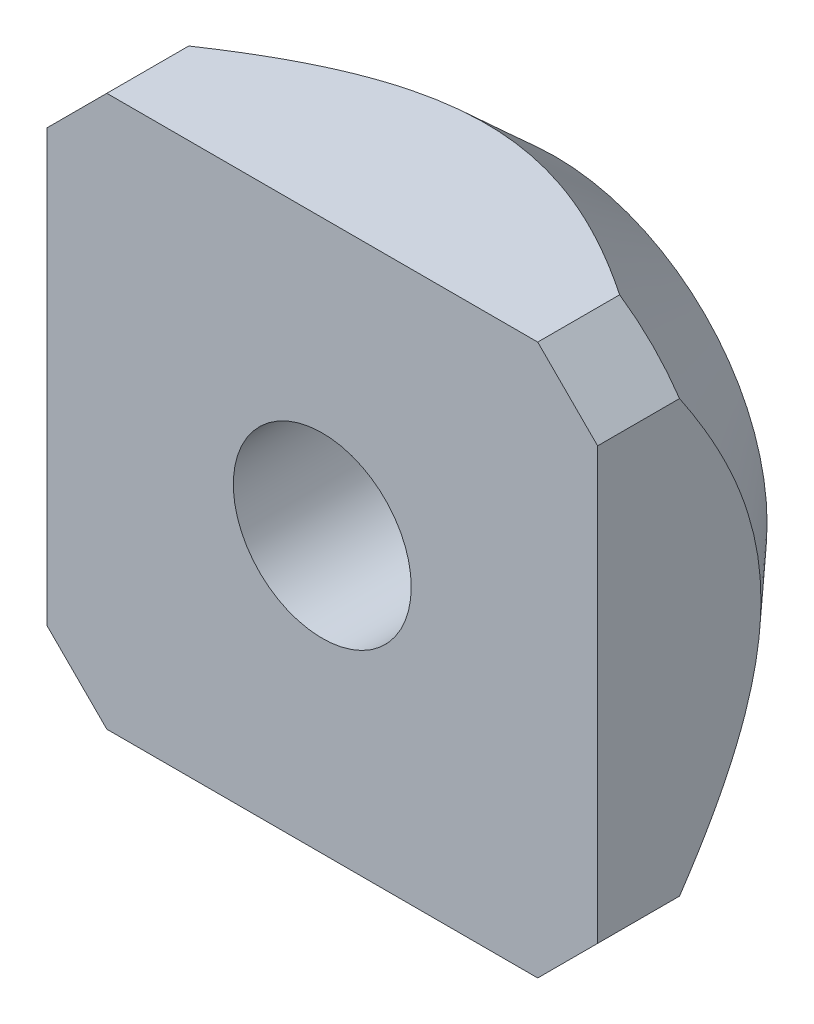
ISO-10303-21;
HEADER;
FILE_DESCRIPTION(('STEP AP214'),'2;1');
FILE_NAME('part.step','',(''),(''),'','','');
FILE_SCHEMA(('AUTOMOTIVE_DESIGN { 1 0 10303 214 1 1 1 1 }'));
ENDSEC;
DATA;
#1=APPLICATION_CONTEXT('core data for automotive mechanical design processes');
#2=APPLICATION_PROTOCOL_DEFINITION('international standard','automotive_design',2000,#1);
#3=PRODUCT_CONTEXT('',#1,'mechanical');
#4=PRODUCT('Part','Part','',(#3));
#5=PRODUCT_RELATED_PRODUCT_CATEGORY('part','',(#4));
#6=PRODUCT_DEFINITION_FORMATION('','',#4);
#7=PRODUCT_DEFINITION_CONTEXT('part definition',#1,'design');
#8=PRODUCT_DEFINITION('design','',#6,#7);
#9=PRODUCT_DEFINITION_SHAPE('','',#8);
#10=(LENGTH_UNIT() NAMED_UNIT(*) SI_UNIT(.MILLI.,.METRE.));
#11=(NAMED_UNIT(*) PLANE_ANGLE_UNIT() SI_UNIT($,.RADIAN.));
#12=(NAMED_UNIT(*) SI_UNIT($,.STERADIAN.) SOLID_ANGLE_UNIT());
#13=UNCERTAINTY_MEASURE_WITH_UNIT(LENGTH_MEASURE(1.E-05),#10,'distance_accuracy_value','');
#14=(GEOMETRIC_REPRESENTATION_CONTEXT(3) GLOBAL_UNCERTAINTY_ASSIGNED_CONTEXT((#13)) GLOBAL_UNIT_ASSIGNED_CONTEXT((#10,
#11,#12)) REPRESENTATION_CONTEXT('',''));
#15=CARTESIAN_POINT('',(0.,0.,0.));
#16=DIRECTION('',(0.,0.,1.));
#17=DIRECTION('',(1.,0.,0.));
#18=AXIS2_PLACEMENT_3D('',#15,#16,#17);
#19=CARTESIAN_POINT('',(0.,0.,-5.5));
#20=DIRECTION('',(0.,0.,1.));
#21=DIRECTION('',(1.,0.,0.));
#22=AXIS2_PLACEMENT_3D('',#19,#20,#21);
#23=PLANE('',#22);
#24=CARTESIAN_POINT('',(0.,0.,-5.5));
#25=DIRECTION('',(0.,0.,1.));
#26=DIRECTION('',(1.,0.,0.));
#27=AXIS2_PLACEMENT_3D('',#24,#25,#26);
#28=CIRCLE('',#27,2.1);
#29=CARTESIAN_POINT('',(2.1,0.,-5.5));
#30=VERTEX_POINT('',#29);
#31=EDGE_CURVE('E246',#30,#30,#28,.T.);
#32=ORIENTED_EDGE('',*,*,#31,.T.);
#33=EDGE_LOOP('',(#32));
#34=FACE_BOUND('',#33,.T.);
#35=CARTESIAN_POINT('',(0.,0.,-5.50000000287154));
#36=DIRECTION('',(0.,0.,1.));
#37=DIRECTION('',(1.,0.,0.));
#38=AXIS2_PLACEMENT_3D('',#35,#36,#37);
#39=CIRCLE('',#38,5.00000000314824);
#40=CARTESIAN_POINT('',(5.00000000314824,0.,-5.50000000287154));
#41=VERTEX_POINT('',#40);
#42=EDGE_CURVE('E33',#41,#41,#39,.T.);
#43=ORIENTED_EDGE('',*,*,#42,.F.);
#44=EDGE_LOOP('',(#43));
#45=FACE_BOUND('',#44,.T.);
#46=ADVANCED_FACE('F30',(#34,#45),#23,.F.);
#47=CARTESIAN_POINT('',(0.,0.,-1.91193420733516));
#48=DIRECTION('',(0.,0.,1.));
#49=DIRECTION('',(1.,0.,0.));
#50=AXIS2_PLACEMENT_3D('',#47,#48,#49);
#51=CONICAL_SURFACE('',#50,8.27271392518171,0.739466056088912);
#52=ORIENTED_EDGE('',*,*,#42,.T.);
#53=EDGE_LOOP('',(#52));
#54=FACE_BOUND('',#53,.T.);
#55=CARTESIAN_POINT('',(-6.49999999996656,5.08578643774263,-1.93333420218814));
#56=CARTESIAN_POINT('',(-6.49999999998799,4.97217656549041,-2.01007902749409));
#57=CARTESIAN_POINT('',(-6.49999999999678,4.85782950972393,-2.08574579284289));
#58=CARTESIAN_POINT('',(-6.50000000000322,4.62749756275461,-2.23459577320099));
#59=CARTESIAN_POINT('',(-6.50000000000086,4.51151233122406,-2.30777846107305));
#60=CARTESIAN_POINT('',(-6.49999999999913,4.27735001893202,-2.45156937006614));
#61=CARTESIAN_POINT('',(-6.49999999999976,4.15916634847437,-2.52216690472437));
#62=CARTESIAN_POINT('',(-6.50000000000024,3.92090179825337,-2.66006146574261));
#63=CARTESIAN_POINT('',(-6.50000000000008,3.80082102170299,-2.72735867084667));
#64=CARTESIAN_POINT('',(-6.49999999999983,3.43117049901182,-2.927024197621));
#65=CARTESIAN_POINT('',(-6.49999999999995,3.17828163281151,-3.05336340735418));
#66=CARTESIAN_POINT('',(-6.50000000000004,2.66320472724055,-3.2847897494762));
#67=CARTESIAN_POINT('',(-6.50000000000001,2.40103115726329,-3.38990837532806));
#68=CARTESIAN_POINT('',(-6.49999999999999,1.96194937878003,-3.54007016332442));
#69=CARTESIAN_POINT('',(-6.5,1.78780916432668,-3.5931930058844));
#70=CARTESIAN_POINT('',(-6.5,1.43593803357401,-3.68604206605222));
#71=CARTESIAN_POINT('',(-6.5,1.25820705951024,-3.72576806796325));
#72=CARTESIAN_POINT('',(-6.5,0.901971243864608,-3.78972854936986));
#73=CARTESIAN_POINT('',(-6.5,0.723496609813822,-3.81412921930872));
#74=CARTESIAN_POINT('',(-6.5,0.365074863040264,-3.84691624104865));
#75=CARTESIAN_POINT('',(-6.5,0.185127876429945,-3.85530395029257));
#76=CARTESIAN_POINT('',(-6.5,-0.175331996863656,-3.85561829853934));
#77=CARTESIAN_POINT('',(-6.5,-0.355844930170432,-3.84749448568778));
#78=CARTESIAN_POINT('',(-6.5,-0.715412000901114,-3.81512247996494));
#79=CARTESIAN_POINT('',(-6.5,-0.894466007670494,-3.79087285866508));
#80=CARTESIAN_POINT('',(-6.5,-1.25186987190293,-3.72710369302864));
#81=CARTESIAN_POINT('',(-6.5,-1.43018938883302,-3.6874161876482));
#82=CARTESIAN_POINT('',(-6.5,-1.7832209983363,-3.59454247061222));
#83=CARTESIAN_POINT('',(-6.5,-1.95793314761956,-3.54135647133646));
#84=CARTESIAN_POINT('',(-6.5,-2.39791270686289,-3.39110767153733));
#85=CARTESIAN_POINT('',(-6.5,-2.66041462883235,-3.2859613732665));
#86=CARTESIAN_POINT('',(-6.5,-3.17612601907367,-3.05441341529704));
#87=CARTESIAN_POINT('',(-6.5,-3.4293209389517,-2.92798006949308));
#88=CARTESIAN_POINT('',(-6.5,-3.79940591229883,-2.72814379751195));
#89=CARTESIAN_POINT('',(-6.5,-3.91962359960432,-2.66078705978884));
#90=CARTESIAN_POINT('',(-6.5,-4.15815744619399,-2.52276484072712));
#91=CARTESIAN_POINT('',(-6.5,-4.27647350172637,-2.45209917967338));
#92=CARTESIAN_POINT('',(-6.5,-4.510894297226,-2.30816632365151));
#93=CARTESIAN_POINT('',(-6.5,-4.62700566745187,-2.23490988206234));
#94=CARTESIAN_POINT('',(-6.5,-4.85758619181249,-2.08590677964123));
#95=CARTESIAN_POINT('',(-6.5,-4.97205568825616,-2.01016064904319));
#96=CARTESIAN_POINT('',(-6.5,-5.08578643774838,-1.93333420220499));
#97=B_SPLINE_CURVE_WITH_KNOTS('',3,(#55,#56,#57,#58,#59,#60,#61,#62,#63,#64,#65,#66,#67,#68,#69,
#70,#71,#72,#73,#74,#75,#76,#77,#78,#79,#80,#81,#82,#83,#84,#85,#86,#87,#88,#89,#90,#91,#92,#93,
#94,#95,#96),.UNSPECIFIED.,.F.,.F.,(4,2,2,2,2,2,2,2,2,2,2,2,2,2,2,2,2,2,2,2,4),(0.,
0.41131042679013,0.822707597462602,1.23564791332838,1.64856583981778,2.49590493844257,
3.34197710361053,3.88772071571207,4.43347311417834,4.97320018567055,5.51288150165221,
6.05421432221896,6.59559510058552,7.1430386002873,7.69047348727104,8.53748456918338,
9.38576777125056,9.79913116863559,10.2125170428237,10.6243522063669,11.0361002217524),.UNSPECIFIED.);
#98=CARTESIAN_POINT('',(-6.50000000001247,5.08578643767711,-1.93333420224238));
#99=VERTEX_POINT('',#98);
#100=CARTESIAN_POINT('',(-6.50000000001247,-5.08578643767711,-1.93333420224238));
#101=VERTEX_POINT('',#100);
#102=EDGE_CURVE('E159',#99,#101,#97,.T.);
#103=ORIENTED_EDGE('',*,*,#102,.F.);
#104=CARTESIAN_POINT('',(-5.08578643758324,6.50000000000418,-1.93333420227152));
#105=CARTESIAN_POINT('',(-5.20320338743552,6.38258305017716,-1.95544496406807));
#106=CARTESIAN_POINT('',(-5.32114245529566,6.26464398232743,-1.97213629505099));
#107=CARTESIAN_POINT('',(-5.55702028333326,6.02876615429746,-1.99438943436884));
#108=CARTESIAN_POINT('',(-5.6749567510727,5.9108296865553,-2.00000000038364));
#109=CARTESIAN_POINT('',(-5.91082968655301,5.67495675107281,-2.00000000038308));
#110=CARTESIAN_POINT('',(-6.02876615429389,5.55702028333248,-1.99438943436772));
#111=CARTESIAN_POINT('',(-6.2646439823281,5.32114245529936,-1.97213629505239));
#112=CARTESIAN_POINT('',(-6.38258305018337,5.20320338744464,-1.95544496407257));
#113=CARTESIAN_POINT('',(-6.50000000002287,5.08578643760404,-1.93333420228277));
#114=B_SPLINE_CURVE_WITH_KNOTS('',3,(#104,#105,#106,#107,#108,#109,#110,#111,#112,#113),
.UNSPECIFIED.,.F.,.F.,(4,2,2,2,4),(0.,0.502492195093159,1.00276834929097,1.50304450348823,
2.00553669858084),.UNSPECIFIED.);
#115=CARTESIAN_POINT('',(-5.08578643767711,6.50000000001248,-1.93333420224238));
#116=VERTEX_POINT('',#115);
#117=EDGE_CURVE('E165',#116,#99,#114,.T.);
#118=ORIENTED_EDGE('',*,*,#117,.F.);
#119=CARTESIAN_POINT('',(5.08578643774263,6.49999999996657,-1.93333420218813));
#120=CARTESIAN_POINT('',(4.9721765654904,6.49999999998799,-2.01007902749409));
#121=CARTESIAN_POINT('',(4.85782950972392,6.49999999999678,-2.08574579284289));
#122=CARTESIAN_POINT('',(4.62749756275461,6.50000000000322,-2.23459577320099));
#123=CARTESIAN_POINT('',(4.51151233122406,6.50000000000087,-2.30777846107305));
#124=CARTESIAN_POINT('',(4.27735001893202,6.49999999999913,-2.45156937006614));
#125=CARTESIAN_POINT('',(4.15916634847437,6.49999999999976,-2.52216690472436));
#126=CARTESIAN_POINT('',(3.92090179825336,6.50000000000024,-2.66006146574261));
#127=CARTESIAN_POINT('',(3.80082102170299,6.50000000000009,-2.72735867084667));
#128=CARTESIAN_POINT('',(3.43117049901181,6.49999999999983,-2.927024197621));
#129=CARTESIAN_POINT('',(3.17828163281151,6.49999999999996,-3.05336340735418));
#130=CARTESIAN_POINT('',(2.66320472724054,6.50000000000005,-3.2847897494762));
#131=CARTESIAN_POINT('',(2.40103115726328,6.50000000000001,-3.38990837532806));
#132=CARTESIAN_POINT('',(1.96194937878002,6.5,-3.54007016332442));
#133=CARTESIAN_POINT('',(1.78780916432667,6.5,-3.5931930058844));
#134=CARTESIAN_POINT('',(1.435938033574,6.50000000000001,-3.68604206605221));
#135=CARTESIAN_POINT('',(1.25820705951023,6.5,-3.72576806796325));
#136=CARTESIAN_POINT('',(0.901971243864601,6.5,-3.78972854936986));
#137=CARTESIAN_POINT('',(0.723496609813815,6.5,-3.81412921930872));
#138=CARTESIAN_POINT('',(0.365074863040257,6.5,-3.84691624104865));
#139=CARTESIAN_POINT('',(0.185127876429939,6.5,-3.85530395029256));
#140=CARTESIAN_POINT('',(-0.175331996863662,6.5,-3.85561829853934));
#141=CARTESIAN_POINT('',(-0.355844930170438,6.5,-3.84749448568778));
#142=CARTESIAN_POINT('',(-0.715412000901119,6.5,-3.81512247996494));
#143=CARTESIAN_POINT('',(-0.8944660076705,6.5,-3.79087285866508));
#144=CARTESIAN_POINT('',(-1.25186987190293,6.5,-3.72710369302863));
#145=CARTESIAN_POINT('',(-1.43018938883303,6.5,-3.68741618764819));
#146=CARTESIAN_POINT('',(-1.7832209983363,6.5,-3.59454247061221));
#147=CARTESIAN_POINT('',(-1.95793314761956,6.5,-3.54135647133646));
#148=CARTESIAN_POINT('',(-2.3979127068629,6.5,-3.39110767153733));
#149=CARTESIAN_POINT('',(-2.66041462883235,6.5,-3.2859613732665));
#150=CARTESIAN_POINT('',(-3.17612601907368,6.5,-3.05441341529704));
#151=CARTESIAN_POINT('',(-3.4293209389517,6.5,-2.92798006949307));
#152=CARTESIAN_POINT('',(-3.79940591229883,6.5,-2.72814379751195));
#153=CARTESIAN_POINT('',(-3.91962359960432,6.5,-2.66078705978884));
#154=CARTESIAN_POINT('',(-4.15815744619399,6.5,-2.52276484072712));
#155=CARTESIAN_POINT('',(-4.27647350172636,6.5,-2.45209917967338));
#156=CARTESIAN_POINT('',(-4.510894297226,6.5,-2.30816632365151));
#157=CARTESIAN_POINT('',(-4.62700566745187,6.5,-2.23490988206234));
#158=CARTESIAN_POINT('',(-4.85758619181248,6.5,-2.08590677964123));
#159=CARTESIAN_POINT('',(-4.97205568825616,6.5,-2.01016064904319));
#160=CARTESIAN_POINT('',(-5.08578643774838,6.5,-1.93333420220499));
#161=B_SPLINE_CURVE_WITH_KNOTS('',3,(#119,#120,#121,#122,#123,#124,#125,#126,#127,#128,#129,
#130,#131,#132,#133,#134,#135,#136,#137,#138,#139,#140,#141,#142,#143,#144,#145,#146,#147,#148,
#149,#150,#151,#152,#153,#154,#155,#156,#157,#158,#159,#160),.UNSPECIFIED.,.F.,.F.,(4,2,2,2,2,2,
2,2,2,2,2,2,2,2,2,2,2,2,2,2,4),(0.,0.411310426790131,0.822707597462601,1.23564791332838,
1.64856583981778,2.49590493844257,3.34197710361053,3.88772071571208,4.43347311417834,
4.97320018567055,5.51288150165221,6.05421432221896,6.59559510058552,7.1430386002873,
7.69047348727104,8.53748456918337,9.38576777125056,9.79913116863558,10.2125170428237,
10.6243522063669,11.0361002217524),.UNSPECIFIED.);
#162=CARTESIAN_POINT('',(5.08578643767711,6.50000000001247,-1.93333420224238));
#163=VERTEX_POINT('',#162);
#164=EDGE_CURVE('E99',#163,#116,#161,.T.);
#165=ORIENTED_EDGE('',*,*,#164,.F.);
#166=CARTESIAN_POINT('',(6.50000000000418,5.08578643758324,-1.93333420227152));
#167=CARTESIAN_POINT('',(6.38258305017715,5.20320338743553,-1.95544496406807));
#168=CARTESIAN_POINT('',(6.26464398232743,5.32114245529566,-1.97213629505098));
#169=CARTESIAN_POINT('',(6.02876615429745,5.55702028333326,-1.99438943436883));
#170=CARTESIAN_POINT('',(5.9108296865553,5.6749567510727,-2.00000000038364));
#171=CARTESIAN_POINT('',(5.67495675107281,5.91082968655302,-2.00000000038307));
#172=CARTESIAN_POINT('',(5.55702028333247,6.02876615429389,-1.99438943436771));
#173=CARTESIAN_POINT('',(5.32114245529936,6.2646439823281,-1.97213629505239));
#174=CARTESIAN_POINT('',(5.20320338744464,6.38258305018337,-1.95544496407257));
#175=CARTESIAN_POINT('',(5.08578643760404,6.50000000002287,-1.93333420228276));
#176=B_SPLINE_CURVE_WITH_KNOTS('',3,(#166,#167,#168,#169,#170,#171,#172,#173,#174,#175),
.UNSPECIFIED.,.F.,.F.,(4,2,2,2,4),(0.,0.502492195093158,1.00276834929097,1.50304450348823,
2.00553669858084),.UNSPECIFIED.);
#177=CARTESIAN_POINT('',(6.50000000001247,5.08578643761444,-1.93333420228472));
#178=VERTEX_POINT('',#177);
#179=EDGE_CURVE('E93',#178,#163,#176,.T.);
#180=ORIENTED_EDGE('',*,*,#179,.F.);
#181=CARTESIAN_POINT('',(6.49999999996656,-5.08578643774263,-1.93333420218813));
#182=CARTESIAN_POINT('',(6.49999999998799,-4.97217656549041,-2.01007902749409));
#183=CARTESIAN_POINT('',(6.49999999999678,-4.85782950972392,-2.08574579284288));
#184=CARTESIAN_POINT('',(6.50000000000322,-4.62749756275461,-2.23459577320098));
#185=CARTESIAN_POINT('',(6.50000000000087,-4.51151233122406,-2.30777846107305));
#186=CARTESIAN_POINT('',(6.49999999999913,-4.27735001893202,-2.45156937006614));
#187=CARTESIAN_POINT('',(6.49999999999976,-4.15916634847437,-2.52216690472436));
#188=CARTESIAN_POINT('',(6.50000000000024,-3.92090179825336,-2.6600614657426));
#189=CARTESIAN_POINT('',(6.50000000000008,-3.80082102170299,-2.72735867084666));
#190=CARTESIAN_POINT('',(6.49999999999983,-3.43117049901182,-2.927024197621));
#191=CARTESIAN_POINT('',(6.49999999999996,-3.17828163281151,-3.05336340735417));
#192=CARTESIAN_POINT('',(6.50000000000005,-2.66320472724054,-3.2847897494762));
#193=CARTESIAN_POINT('',(6.50000000000001,-2.40103115726328,-3.38990837532806));
#194=CARTESIAN_POINT('',(6.49999999999999,-1.96194937878003,-3.54007016332441));
#195=CARTESIAN_POINT('',(6.5,-1.78780916432667,-3.5931930058844));
#196=CARTESIAN_POINT('',(6.5,-1.435938033574,-3.68604206605221));
#197=CARTESIAN_POINT('',(6.5,-1.25820705951023,-3.72576806796324));
#198=CARTESIAN_POINT('',(6.5,-0.901971243864601,-3.78972854936985));
#199=CARTESIAN_POINT('',(6.5,-0.723496609813815,-3.81412921930872));
#200=CARTESIAN_POINT('',(6.5,-0.365074863040257,-3.84691624104865));
#201=CARTESIAN_POINT('',(6.5,-0.185127876429938,-3.85530395029256));
#202=CARTESIAN_POINT('',(6.5,0.175331996863663,-3.85561829853934));
#203=CARTESIAN_POINT('',(6.5,0.355844930170439,-3.84749448568778));
#204=CARTESIAN_POINT('',(6.5,0.715412000901121,-3.81512247996494));
#205=CARTESIAN_POINT('',(6.5,0.894466007670502,-3.79087285866508));
#206=CARTESIAN_POINT('',(6.5,1.25186987190294,-3.72710369302863));
#207=CARTESIAN_POINT('',(6.5,1.43018938883303,-3.68741618764819));
#208=CARTESIAN_POINT('',(6.5,1.7832209983363,-3.59454247061221));
#209=CARTESIAN_POINT('',(6.5,1.95793314761957,-3.54135647133646));
#210=CARTESIAN_POINT('',(6.5,2.3979127068629,-3.39110767153733));
#211=CARTESIAN_POINT('',(6.5,2.66041462883236,-3.2859613732665));
#212=CARTESIAN_POINT('',(6.5,3.17612601907368,-3.05441341529703));
#213=CARTESIAN_POINT('',(6.5,3.42932093895171,-2.92798006949307));
#214=CARTESIAN_POINT('',(6.5,3.79940591229883,-2.72814379751194));
#215=CARTESIAN_POINT('',(6.5,3.91962359960432,-2.66078705978883));
#216=CARTESIAN_POINT('',(6.5,4.15815744619399,-2.52276484072711));
#217=CARTESIAN_POINT('',(6.5,4.27647350172637,-2.45209917967337));
#218=CARTESIAN_POINT('',(6.5,4.51089429722601,-2.30816632365151));
#219=CARTESIAN_POINT('',(6.5,4.62700566745188,-2.23490988206234));
#220=CARTESIAN_POINT('',(6.5,4.85758619181249,-2.08590677964122));
#221=CARTESIAN_POINT('',(6.5,4.97205568825616,-2.01016064904319));
#222=CARTESIAN_POINT('',(6.5,5.08578643774839,-1.93333420220499));
#223=B_SPLINE_CURVE_WITH_KNOTS('',3,(#181,#182,#183,#184,#185,#186,#187,#188,#189,#190,#191,
#192,#193,#194,#195,#196,#197,#198,#199,#200,#201,#202,#203,#204,#205,#206,#207,#208,#209,#210,
#211,#212,#213,#214,#215,#216,#217,#218,#219,#220,#221,#222),.UNSPECIFIED.,.F.,.F.,(4,2,2,2,2,2,
2,2,2,2,2,2,2,2,2,2,2,2,2,2,4),(0.,0.411310426790131,0.822707597462602,1.23564791332838,
1.64856583981778,2.49590493844257,3.34197710361053,3.88772071571208,4.43347311417835,
4.97320018567056,5.51288150165222,6.05421432221896,6.59559510058553,7.14303860028731,
7.69047348727105,8.53748456918338,9.38576777125057,9.79913116863559,10.2125170428237,
10.6243522063669,11.0361002217524),.UNSPECIFIED.);
#224=CARTESIAN_POINT('',(6.50000000001247,-5.08578643767711,-1.93333420224237));
#225=VERTEX_POINT('',#224);
#226=EDGE_CURVE('E97',#225,#178,#223,.T.);
#227=ORIENTED_EDGE('',*,*,#226,.F.);
#228=CARTESIAN_POINT('',(5.08578643758324,-6.50000000000418,-1.93333420227152));
#229=CARTESIAN_POINT('',(5.20320338743552,-6.38258305017716,-1.95544496406807));
#230=CARTESIAN_POINT('',(5.32114245529566,-6.26464398232743,-1.97213629505098));
#231=CARTESIAN_POINT('',(5.55702028333326,-6.02876615429746,-1.99438943436883));
#232=CARTESIAN_POINT('',(5.6749567510727,-5.9108296865553,-2.00000000038364));
#233=CARTESIAN_POINT('',(5.91082968655301,-5.67495675107281,-2.00000000038307));
#234=CARTESIAN_POINT('',(6.02876615429389,-5.55702028333248,-1.99438943436771));
#235=CARTESIAN_POINT('',(6.2646439823281,-5.32114245529936,-1.97213629505238));
#236=CARTESIAN_POINT('',(6.38258305018337,-5.20320338744464,-1.95544496407256));
#237=CARTESIAN_POINT('',(6.50000000002286,-5.08578643760405,-1.93333420228276));
#238=B_SPLINE_CURVE_WITH_KNOTS('',3,(#228,#229,#230,#231,#232,#233,#234,#235,#236,#237),
.UNSPECIFIED.,.F.,.F.,(4,2,2,2,4),(0.,0.502492195093158,1.00276834929097,1.50304450348823,
2.00553669858084),.UNSPECIFIED.);
#239=CARTESIAN_POINT('',(5.08578643767711,-6.50000000001247,-1.93333420224237));
#240=VERTEX_POINT('',#239);
#241=EDGE_CURVE('E113',#240,#225,#238,.T.);
#242=ORIENTED_EDGE('',*,*,#241,.F.);
#243=CARTESIAN_POINT('',(-5.08578643774262,-6.49999999996657,-1.93333420218813));
#244=CARTESIAN_POINT('',(-4.9721765654904,-6.49999999998799,-2.01007902749409));
#245=CARTESIAN_POINT('',(-4.85782950972392,-6.49999999999678,-2.08574579284288));
#246=CARTESIAN_POINT('',(-4.62749756275461,-6.50000000000322,-2.23459577320099));
#247=CARTESIAN_POINT('',(-4.51151233122405,-6.50000000000087,-2.30777846107305));
#248=CARTESIAN_POINT('',(-4.27735001893202,-6.49999999999913,-2.45156937006614));
#249=CARTESIAN_POINT('',(-4.15916634847437,-6.49999999999976,-2.52216690472436));
#250=CARTESIAN_POINT('',(-3.92090179825336,-6.50000000000024,-2.6600614657426));
#251=CARTESIAN_POINT('',(-3.80082102170298,-6.50000000000009,-2.72735867084667));
#252=CARTESIAN_POINT('',(-3.43117049901181,-6.49999999999983,-2.927024197621));
#253=CARTESIAN_POINT('',(-3.1782816328115,-6.49999999999996,-3.05336340735418));
#254=CARTESIAN_POINT('',(-2.66320472724054,-6.50000000000005,-3.2847897494762));
#255=CARTESIAN_POINT('',(-2.40103115726328,-6.50000000000001,-3.38990837532806));
#256=CARTESIAN_POINT('',(-1.96194937878002,-6.5,-3.54007016332441));
#257=CARTESIAN_POINT('',(-1.78780916432667,-6.5,-3.5931930058844));
#258=CARTESIAN_POINT('',(-1.435938033574,-6.5,-3.68604206605221));
#259=CARTESIAN_POINT('',(-1.25820705951023,-6.5,-3.72576806796324));
#260=CARTESIAN_POINT('',(-0.9019712438646,-6.5,-3.78972854936985));
#261=CARTESIAN_POINT('',(-0.723496609813814,-6.5,-3.81412921930872));
#262=CARTESIAN_POINT('',(-0.365074863040256,-6.5,-3.84691624104865));
#263=CARTESIAN_POINT('',(-0.185127876429937,-6.5,-3.85530395029256));
#264=CARTESIAN_POINT('',(0.175331996863664,-6.5,-3.85561829853933));
#265=CARTESIAN_POINT('',(0.35584493017044,-6.5,-3.84749448568777));
#266=CARTESIAN_POINT('',(0.715412000901122,-6.5,-3.81512247996493));
#267=CARTESIAN_POINT('',(0.894466007670503,-6.5,-3.79087285866508));
#268=CARTESIAN_POINT('',(1.25186987190294,-6.5,-3.72710369302863));
#269=CARTESIAN_POINT('',(1.43018938883303,-6.5,-3.68741618764819));
#270=CARTESIAN_POINT('',(1.7832209983363,-6.5,-3.59454247061221));
#271=CARTESIAN_POINT('',(1.95793314761957,-6.5,-3.54135647133645));
#272=CARTESIAN_POINT('',(2.3979127068629,-6.5,-3.39110767153732));
#273=CARTESIAN_POINT('',(2.66041462883236,-6.5,-3.28596137326649));
#274=CARTESIAN_POINT('',(3.17612601907368,-6.5,-3.05441341529703));
#275=CARTESIAN_POINT('',(3.42932093895171,-6.5,-2.92798006949307));
#276=CARTESIAN_POINT('',(3.79940591229883,-6.5,-2.72814379751194));
#277=CARTESIAN_POINT('',(3.91962359960432,-6.5,-2.66078705978883));
#278=CARTESIAN_POINT('',(4.15815744619399,-6.5,-2.52276484072711));
#279=CARTESIAN_POINT('',(4.27647350172637,-6.5,-2.45209917967337));
#280=CARTESIAN_POINT('',(4.510894297226,-6.5,-2.30816632365151));
#281=CARTESIAN_POINT('',(4.62700566745187,-6.5,-2.23490988206233));
#282=CARTESIAN_POINT('',(4.85758619181248,-6.5,-2.08590677964122));
#283=CARTESIAN_POINT('',(4.97205568825616,-6.5,-2.01016064904318));
#284=CARTESIAN_POINT('',(5.08578643774838,-6.5,-1.93333420220499));
#285=B_SPLINE_CURVE_WITH_KNOTS('',3,(#243,#244,#245,#246,#247,#248,#249,#250,#251,#252,#253,
#254,#255,#256,#257,#258,#259,#260,#261,#262,#263,#264,#265,#266,#267,#268,#269,#270,#271,#272,
#273,#274,#275,#276,#277,#278,#279,#280,#281,#282,#283,#284),.UNSPECIFIED.,.F.,.F.,(4,2,2,2,2,2,
2,2,2,2,2,2,2,2,2,2,2,2,2,2,4),(0.,0.411310426790131,0.822707597462601,1.23564791332838,
1.64856583981778,2.49590493844257,3.34197710361053,3.88772071571207,4.43347311417834,
4.97320018567055,5.51288150165221,6.05421432221896,6.59559510058552,7.1430386002873,
7.69047348727104,8.53748456918338,9.38576777125056,9.79913116863558,10.2125170428237,
10.6243522063669,11.0361002217524),.UNSPECIFIED.);
#286=CARTESIAN_POINT('',(-5.08578643767711,-6.50000000001247,-1.93333420224237));
#287=VERTEX_POINT('',#286);
#288=EDGE_CURVE('E146',#287,#240,#285,.T.);
#289=ORIENTED_EDGE('',*,*,#288,.F.);
#290=CARTESIAN_POINT('',(-6.50000000000418,-5.08578643758324,-1.93333420227152));
#291=CARTESIAN_POINT('',(-6.38258305017715,-5.20320338743553,-1.95544496406807));
#292=CARTESIAN_POINT('',(-6.26464398232743,-5.32114245529566,-1.97213629505099));
#293=CARTESIAN_POINT('',(-6.02876615429745,-5.55702028333326,-1.99438943436883));
#294=CARTESIAN_POINT('',(-5.9108296865553,-5.6749567510727,-2.00000000038364));
#295=CARTESIAN_POINT('',(-5.6749567510728,-5.91082968655301,-2.00000000038307));
#296=CARTESIAN_POINT('',(-5.55702028333247,-6.02876615429389,-1.99438943436771));
#297=CARTESIAN_POINT('',(-5.32114245529935,-6.2646439823281,-1.97213629505239));
#298=CARTESIAN_POINT('',(-5.20320338744463,-6.38258305018337,-1.95544496407257));
#299=CARTESIAN_POINT('',(-5.08578643760404,-6.50000000002287,-1.93333420228276));
#300=B_SPLINE_CURVE_WITH_KNOTS('',3,(#290,#291,#292,#293,#294,#295,#296,#297,#298,#299),
.UNSPECIFIED.,.F.,.F.,(4,2,2,2,4),(0.,0.50249219509316,1.00276834929097,1.50304450348824,
2.00553669858085),.UNSPECIFIED.);
#301=EDGE_CURVE('E153',#101,#287,#300,.T.);
#302=ORIENTED_EDGE('',*,*,#301,.F.);
#303=EDGE_LOOP('',(#103,#118,#165,#180,#227,#242,#289,#302));
#304=FACE_BOUND('',#303,.T.);
#305=ADVANCED_FACE('F95',(#54,#304),#51,.T.);
#306=CARTESIAN_POINT('',(6.5,5.08578643762691,0.));
#307=DIRECTION('',(0.707106781186548,0.707106781186548,0.));
#308=DIRECTION('',(-0.707106781186548,0.707106781186548,0.));
#309=AXIS2_PLACEMENT_3D('',#306,#307,#308);
#310=PLANE('',#309);
#311=DIRECTION('',(-0.707106781186547,0.707106781186547,0.));
#312=VECTOR('',#311,1.);
#313=CARTESIAN_POINT('',(6.5,5.08578643762691,0.));
#314=LINE('',#313,#312);
#315=CARTESIAN_POINT('',(6.5,5.08578643762691,0.));
#316=VERTEX_POINT('',#315);
#317=CARTESIAN_POINT('',(5.08578643762691,6.5,0.));
#318=VERTEX_POINT('',#317);
#319=EDGE_CURVE('E106',#316,#318,#314,.T.);
#320=ORIENTED_EDGE('',*,*,#319,.F.);
#321=DIRECTION('',(0.,0.,-1.));
#322=VECTOR('',#321,1.);
#323=CARTESIAN_POINT('',(6.5,5.08578643762691,0.));
#324=LINE('',#323,#322);
#325=EDGE_CURVE('E103',#178,#316,#324,.F.);
#326=ORIENTED_EDGE('',*,*,#325,.F.);
#327=ORIENTED_EDGE('',*,*,#179,.T.);
#328=DIRECTION('',(0.,0.,1.));
#329=VECTOR('',#328,1.);
#330=CARTESIAN_POINT('',(5.08578643762691,6.5,0.));
#331=LINE('',#330,#329);
#332=EDGE_CURVE('E172',#318,#163,#331,.F.);
#333=ORIENTED_EDGE('',*,*,#332,.F.);
#334=EDGE_LOOP('',(#320,#326,#327,#333));
#335=FACE_BOUND('',#334,.T.);
#336=ADVANCED_FACE('F104',(#335),#310,.T.);
#337=CARTESIAN_POINT('',(5.08578643762691,6.5,0.));
#338=DIRECTION('',(0.,1.,0.));
#339=DIRECTION('',(0.,0.,1.));
#340=AXIS2_PLACEMENT_3D('',#337,#338,#339);
#341=PLANE('',#340);
#342=DIRECTION('',(1.,0.,0.));
#343=VECTOR('',#342,1.);
#344=CARTESIAN_POINT('',(0.,6.5,0.));
#345=LINE('',#344,#343);
#346=CARTESIAN_POINT('',(-5.0857864376269,6.50000000000001,0.));
#347=VERTEX_POINT('',#346);
#348=EDGE_CURVE('E121',#318,#347,#345,.F.);
#349=ORIENTED_EDGE('',*,*,#348,.F.);
#350=ORIENTED_EDGE('',*,*,#332,.T.);
#351=ORIENTED_EDGE('',*,*,#164,.T.);
#352=DIRECTION('',(0.,0.,1.));
#353=VECTOR('',#352,1.);
#354=CARTESIAN_POINT('',(-5.0857864376269,6.50000000000001,0.));
#355=LINE('',#354,#353);
#356=EDGE_CURVE('E171',#347,#116,#355,.F.);
#357=ORIENTED_EDGE('',*,*,#356,.F.);
#358=EDGE_LOOP('',(#349,#350,#351,#357));
#359=FACE_BOUND('',#358,.T.);
#360=ADVANCED_FACE('F180',(#359),#341,.T.);
#361=CARTESIAN_POINT('',(-5.0857864376269,6.50000000000001,0.));
#362=DIRECTION('',(-0.707106781186548,0.707106781186548,0.));
#363=DIRECTION('',(-0.707106781186548,-0.707106781186548,0.));
#364=AXIS2_PLACEMENT_3D('',#361,#362,#363);
#365=PLANE('',#364);
#366=DIRECTION('',(-0.707106781186547,-0.707106781186547,0.));
#367=VECTOR('',#366,1.);
#368=CARTESIAN_POINT('',(-5.0857864376269,6.50000000000001,0.));
#369=LINE('',#368,#367);
#370=CARTESIAN_POINT('',(-6.5,5.08578643762691,0.));
#371=VERTEX_POINT('',#370);
#372=EDGE_CURVE('E219',#347,#371,#369,.T.);
#373=ORIENTED_EDGE('',*,*,#372,.F.);
#374=ORIENTED_EDGE('',*,*,#356,.T.);
#375=ORIENTED_EDGE('',*,*,#117,.T.);
#376=DIRECTION('',(0.,0.,1.));
#377=VECTOR('',#376,1.);
#378=CARTESIAN_POINT('',(-6.5,5.08578643762691,0.));
#379=LINE('',#378,#377);
#380=EDGE_CURVE('E226',#371,#99,#379,.F.);
#381=ORIENTED_EDGE('',*,*,#380,.F.);
#382=EDGE_LOOP('',(#373,#374,#375,#381));
#383=FACE_BOUND('',#382,.T.);
#384=ADVANCED_FACE('F176',(#383),#365,.T.);
#385=CARTESIAN_POINT('',(-6.5,5.08578643762691,0.));
#386=DIRECTION('',(-1.,0.,0.));
#387=DIRECTION('',(0.,0.,1.));
#388=AXIS2_PLACEMENT_3D('',#385,#386,#387);
#389=PLANE('',#388);
#390=DIRECTION('',(0.,1.,0.));
#391=VECTOR('',#390,1.);
#392=CARTESIAN_POINT('',(-6.5,0.,0.));
#393=LINE('',#392,#391);
#394=CARTESIAN_POINT('',(-6.5,-5.08578643762691,0.));
#395=VERTEX_POINT('',#394);
#396=EDGE_CURVE('E217',#371,#395,#393,.F.);
#397=ORIENTED_EDGE('',*,*,#396,.F.);
#398=ORIENTED_EDGE('',*,*,#380,.T.);
#399=ORIENTED_EDGE('',*,*,#102,.T.);
#400=DIRECTION('',(0.,0.,1.));
#401=VECTOR('',#400,1.);
#402=CARTESIAN_POINT('',(-6.5,-5.08578643762691,0.));
#403=LINE('',#402,#401);
#404=EDGE_CURVE('E232',#395,#101,#403,.F.);
#405=ORIENTED_EDGE('',*,*,#404,.F.);
#406=EDGE_LOOP('',(#397,#398,#399,#405));
#407=FACE_BOUND('',#406,.T.);
#408=ADVANCED_FACE('F179',(#407),#389,.T.);
#409=CARTESIAN_POINT('',(-6.5,-5.08578643762691,0.));
#410=DIRECTION('',(-0.707106781186548,-0.707106781186548,0.));
#411=DIRECTION('',(0.707106781186548,-0.707106781186548,0.));
#412=AXIS2_PLACEMENT_3D('',#409,#410,#411);
#413=PLANE('',#412);
#414=DIRECTION('',(0.707106781186547,-0.707106781186548,0.));
#415=VECTOR('',#414,1.);
#416=CARTESIAN_POINT('',(-6.5,-5.08578643762691,0.));
#417=LINE('',#416,#415);
#418=CARTESIAN_POINT('',(-5.08578643762691,-6.5,0.));
#419=VERTEX_POINT('',#418);
#420=EDGE_CURVE('E211',#395,#419,#417,.T.);
#421=ORIENTED_EDGE('',*,*,#420,.F.);
#422=ORIENTED_EDGE('',*,*,#404,.T.);
#423=ORIENTED_EDGE('',*,*,#301,.T.);
#424=DIRECTION('',(0.,0.,-1.));
#425=VECTOR('',#424,1.);
#426=CARTESIAN_POINT('',(-5.08578643762691,-6.5,0.));
#427=LINE('',#426,#425);
#428=EDGE_CURVE('E238',#419,#287,#427,.T.);
#429=ORIENTED_EDGE('',*,*,#428,.F.);
#430=EDGE_LOOP('',(#421,#422,#423,#429));
#431=FACE_BOUND('',#430,.T.);
#432=ADVANCED_FACE('F235',(#431),#413,.T.);
#433=CARTESIAN_POINT('',(-5.08578643762691,-6.5,0.));
#434=DIRECTION('',(0.,-1.,0.));
#435=DIRECTION('',(0.,0.,-1.));
#436=AXIS2_PLACEMENT_3D('',#433,#434,#435);
#437=PLANE('',#436);
#438=DIRECTION('',(1.,0.,0.));
#439=VECTOR('',#438,1.);
#440=CARTESIAN_POINT('',(0.,-6.5,0.));
#441=LINE('',#440,#439);
#442=CARTESIAN_POINT('',(5.08578643762691,-6.5,0.));
#443=VERTEX_POINT('',#442);
#444=EDGE_CURVE('E209',#419,#443,#441,.T.);
#445=ORIENTED_EDGE('',*,*,#444,.F.);
#446=ORIENTED_EDGE('',*,*,#428,.T.);
#447=ORIENTED_EDGE('',*,*,#288,.T.);
#448=DIRECTION('',(0.,0.,1.));
#449=VECTOR('',#448,1.);
#450=CARTESIAN_POINT('',(5.08578643762691,-6.5,0.));
#451=LINE('',#450,#449);
#452=EDGE_CURVE('E110',#443,#240,#451,.F.);
#453=ORIENTED_EDGE('',*,*,#452,.F.);
#454=EDGE_LOOP('',(#445,#446,#447,#453));
#455=FACE_BOUND('',#454,.T.);
#456=ADVANCED_FACE('F242',(#455),#437,.T.);
#457=CARTESIAN_POINT('',(5.08578643762691,-6.5,0.));
#458=DIRECTION('',(0.707106781186548,-0.707106781186548,0.));
#459=DIRECTION('',(0.707106781186548,0.707106781186548,0.));
#460=AXIS2_PLACEMENT_3D('',#457,#458,#459);
#461=PLANE('',#460);
#462=DIRECTION('',(0.707106781186547,0.707106781186548,0.));
#463=VECTOR('',#462,1.);
#464=CARTESIAN_POINT('',(5.08578643762691,-6.5,0.));
#465=LINE('',#464,#463);
#466=CARTESIAN_POINT('',(6.5,-5.08578643762691,0.));
#467=VERTEX_POINT('',#466);
#468=EDGE_CURVE('E39',#443,#467,#465,.T.);
#469=ORIENTED_EDGE('',*,*,#468,.F.);
#470=ORIENTED_EDGE('',*,*,#452,.T.);
#471=ORIENTED_EDGE('',*,*,#241,.T.);
#472=DIRECTION('',(0.,0.,-1.));
#473=VECTOR('',#472,1.);
#474=CARTESIAN_POINT('',(6.5,-5.08578643762691,0.));
#475=LINE('',#474,#473);
#476=EDGE_CURVE('E48',#467,#225,#475,.T.);
#477=ORIENTED_EDGE('',*,*,#476,.F.);
#478=EDGE_LOOP('',(#469,#470,#471,#477));
#479=FACE_BOUND('',#478,.T.);
#480=ADVANCED_FACE('F200',(#479),#461,.T.);
#481=CARTESIAN_POINT('',(6.5,-5.08578643762691,0.));
#482=DIRECTION('',(1.,0.,0.));
#483=DIRECTION('',(0.,0.,-1.));
#484=AXIS2_PLACEMENT_3D('',#481,#482,#483);
#485=PLANE('',#484);
#486=DIRECTION('',(0.,1.,0.));
#487=VECTOR('',#486,1.);
#488=CARTESIAN_POINT('',(6.5,0.,0.));
#489=LINE('',#488,#487);
#490=EDGE_CURVE('E11',#467,#316,#489,.T.);
#491=ORIENTED_EDGE('',*,*,#490,.F.);
#492=ORIENTED_EDGE('',*,*,#476,.T.);
#493=ORIENTED_EDGE('',*,*,#226,.T.);
#494=ORIENTED_EDGE('',*,*,#325,.T.);
#495=EDGE_LOOP('',(#491,#492,#493,#494));
#496=FACE_BOUND('',#495,.T.);
#497=ADVANCED_FACE('F109',(#496),#485,.T.);
#498=CARTESIAN_POINT('',(0.,0.,0.));
#499=DIRECTION('',(0.,0.,1.));
#500=DIRECTION('',(1.,0.,0.));
#501=AXIS2_PLACEMENT_3D('',#498,#499,#500);
#502=PLANE('',#501);
#503=CARTESIAN_POINT('',(0.,0.,0.));
#504=DIRECTION('',(0.,0.,1.));
#505=DIRECTION('',(1.,0.,0.));
#506=AXIS2_PLACEMENT_3D('',#503,#504,#505);
#507=CIRCLE('',#506,2.1);
#508=CARTESIAN_POINT('',(2.1,0.,0.));
#509=VERTEX_POINT('',#508);
#510=EDGE_CURVE('E204',#509,#509,#507,.T.);
#511=ORIENTED_EDGE('',*,*,#510,.F.);
#512=EDGE_LOOP('',(#511));
#513=FACE_BOUND('',#512,.T.);
#514=ORIENTED_EDGE('',*,*,#468,.T.);
#515=ORIENTED_EDGE('',*,*,#490,.T.);
#516=ORIENTED_EDGE('',*,*,#319,.T.);
#517=ORIENTED_EDGE('',*,*,#348,.T.);
#518=ORIENTED_EDGE('',*,*,#372,.T.);
#519=ORIENTED_EDGE('',*,*,#396,.T.);
#520=ORIENTED_EDGE('',*,*,#420,.T.);
#521=ORIENTED_EDGE('',*,*,#444,.T.);
#522=EDGE_LOOP('',(#514,#515,#516,#517,#518,#519,#520,#521));
#523=FACE_BOUND('',#522,.T.);
#524=ADVANCED_FACE('F190',(#513,#523),#502,.T.);
#525=CARTESIAN_POINT('',(0.,0.,0.));
#526=DIRECTION('',(0.,0.,1.));
#527=DIRECTION('',(1.,0.,0.));
#528=AXIS2_PLACEMENT_3D('',#525,#526,#527);
#529=CYLINDRICAL_SURFACE('',#528,2.1);
#530=ORIENTED_EDGE('',*,*,#510,.T.);
#531=EDGE_LOOP('',(#530));
#532=FACE_BOUND('',#531,.T.);
#533=ORIENTED_EDGE('',*,*,#31,.F.);
#534=EDGE_LOOP('',(#533));
#535=FACE_BOUND('',#534,.T.);
#536=ADVANCED_FACE('F192',(#532,#535),#529,.F.);
#537=CLOSED_SHELL('',(#46,#305,#336,#360,#384,#408,#432,#456,#480,#497,#524,#536));
#538=MANIFOLD_SOLID_BREP('B2',#537);
#539=ADVANCED_BREP_SHAPE_REPRESENTATION('',(#18,#538),#14);
#540=SHAPE_DEFINITION_REPRESENTATION(#9,#539);
ENDSEC;
END-ISO-10303-21;
